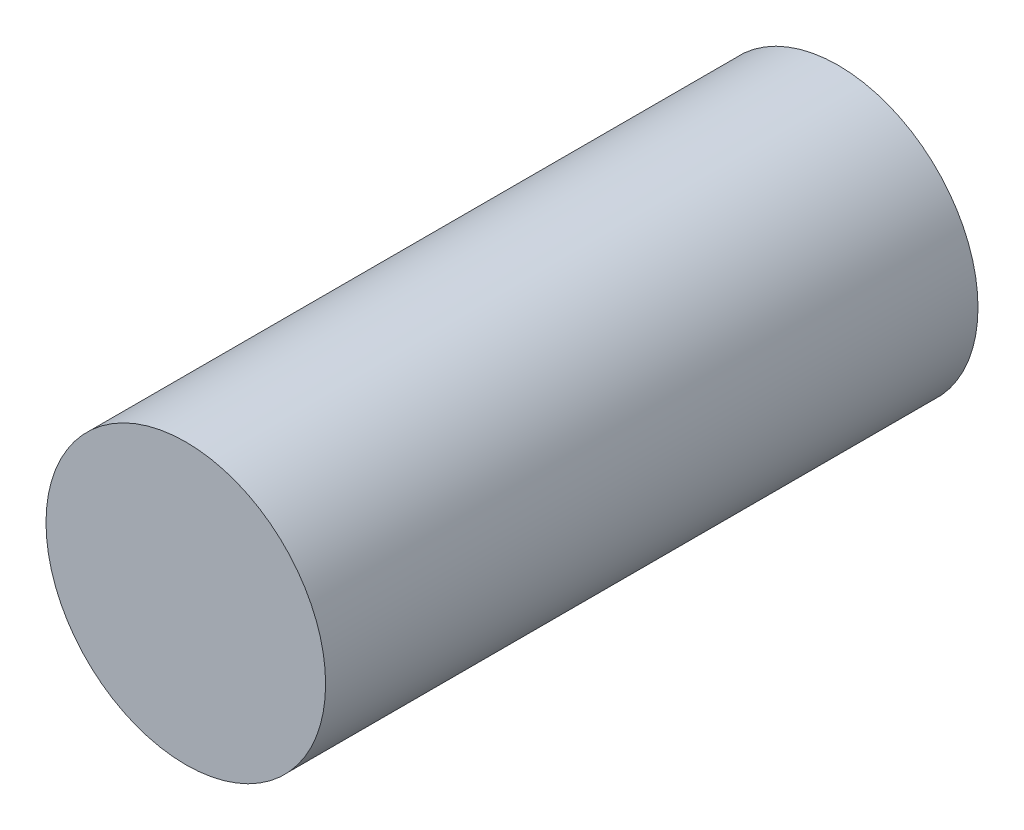
ISO-10303-21;
HEADER;
FILE_DESCRIPTION(('STEP AP214'),'2;1');
FILE_NAME('part.step','',(''),(''),'','','');
FILE_SCHEMA(('AUTOMOTIVE_DESIGN { 1 0 10303 214 1 1 1 1 }'));
ENDSEC;
DATA;
#1=APPLICATION_CONTEXT('core data for automotive mechanical design processes');
#2=APPLICATION_PROTOCOL_DEFINITION('international standard','automotive_design',2000,#1);
#3=PRODUCT_CONTEXT('',#1,'mechanical');
#4=PRODUCT('Part','Part','',(#3));
#5=PRODUCT_RELATED_PRODUCT_CATEGORY('part','',(#4));
#6=PRODUCT_DEFINITION_FORMATION('','',#4);
#7=PRODUCT_DEFINITION_CONTEXT('part definition',#1,'design');
#8=PRODUCT_DEFINITION('design','',#6,#7);
#9=PRODUCT_DEFINITION_SHAPE('','',#8);
#10=(LENGTH_UNIT() NAMED_UNIT(*) SI_UNIT(.MILLI.,.METRE.));
#11=(NAMED_UNIT(*) PLANE_ANGLE_UNIT() SI_UNIT($,.RADIAN.));
#12=(NAMED_UNIT(*) SI_UNIT($,.STERADIAN.) SOLID_ANGLE_UNIT());
#13=UNCERTAINTY_MEASURE_WITH_UNIT(LENGTH_MEASURE(1.E-05),#10,'distance_accuracy_value','');
#14=(GEOMETRIC_REPRESENTATION_CONTEXT(3) GLOBAL_UNCERTAINTY_ASSIGNED_CONTEXT((#13)) GLOBAL_UNIT_ASSIGNED_CONTEXT((#10,
#11,#12)) REPRESENTATION_CONTEXT('',''));
#15=CARTESIAN_POINT('',(0.,0.,0.));
#16=DIRECTION('',(0.,0.,1.));
#17=DIRECTION('',(1.,0.,0.));
#18=AXIS2_PLACEMENT_3D('',#15,#16,#17);
#19=CARTESIAN_POINT('',(0.,0.,14.));
#20=DIRECTION('',(0.,0.,-1.));
#21=DIRECTION('',(-1.,0.,0.));
#22=AXIS2_PLACEMENT_3D('',#19,#20,#21);
#23=CYLINDRICAL_SURFACE('',#22,3.);
#24=CARTESIAN_POINT('',(0.,0.,14.));
#25=DIRECTION('',(0.,0.,1.));
#26=DIRECTION('',(1.,0.,0.));
#27=AXIS2_PLACEMENT_3D('',#24,#25,#26);
#28=CIRCLE('',#27,3.);
#29=CARTESIAN_POINT('',(3.,0.,14.));
#30=VERTEX_POINT('',#29);
#31=EDGE_CURVE('E10',#30,#30,#28,.T.);
#32=ORIENTED_EDGE('',*,*,#31,.F.);
#33=EDGE_LOOP('',(#32));
#34=FACE_BOUND('',#33,.T.);
#35=CARTESIAN_POINT('',(0.,0.,0.));
#36=DIRECTION('',(0.,0.,1.));
#37=DIRECTION('',(1.,0.,0.));
#38=AXIS2_PLACEMENT_3D('',#35,#36,#37);
#39=CIRCLE('',#38,3.);
#40=CARTESIAN_POINT('',(3.,0.,0.));
#41=VERTEX_POINT('',#40);
#42=EDGE_CURVE('E46',#41,#41,#39,.T.);
#43=ORIENTED_EDGE('',*,*,#42,.T.);
#44=EDGE_LOOP('',(#43));
#45=FACE_BOUND('',#44,.T.);
#46=ADVANCED_FACE('F43',(#34,#45),#23,.T.);
#47=CARTESIAN_POINT('',(0.,0.,14.));
#48=DIRECTION('',(0.,0.,1.));
#49=DIRECTION('',(1.,0.,0.));
#50=AXIS2_PLACEMENT_3D('',#47,#48,#49);
#51=PLANE('',#50);
#52=ORIENTED_EDGE('',*,*,#31,.T.);
#53=EDGE_LOOP('',(#52));
#54=FACE_BOUND('',#53,.T.);
#55=ADVANCED_FACE('F58',(#54),#51,.T.);
#56=CARTESIAN_POINT('',(0.,0.,0.));
#57=DIRECTION('',(0.,0.,1.));
#58=DIRECTION('',(1.,0.,0.));
#59=AXIS2_PLACEMENT_3D('',#56,#57,#58);
#60=PLANE('',#59);
#61=ORIENTED_EDGE('',*,*,#42,.F.);
#62=EDGE_LOOP('',(#61));
#63=FACE_BOUND('',#62,.T.);
#64=ADVANCED_FACE('F56',(#63),#60,.F.);
#65=CLOSED_SHELL('',(#46,#55,#64));
#66=MANIFOLD_SOLID_BREP('B2',#65);
#67=ADVANCED_BREP_SHAPE_REPRESENTATION('',(#18,#66),#14);
#68=SHAPE_DEFINITION_REPRESENTATION(#9,#67);
ENDSEC;
END-ISO-10303-21;
